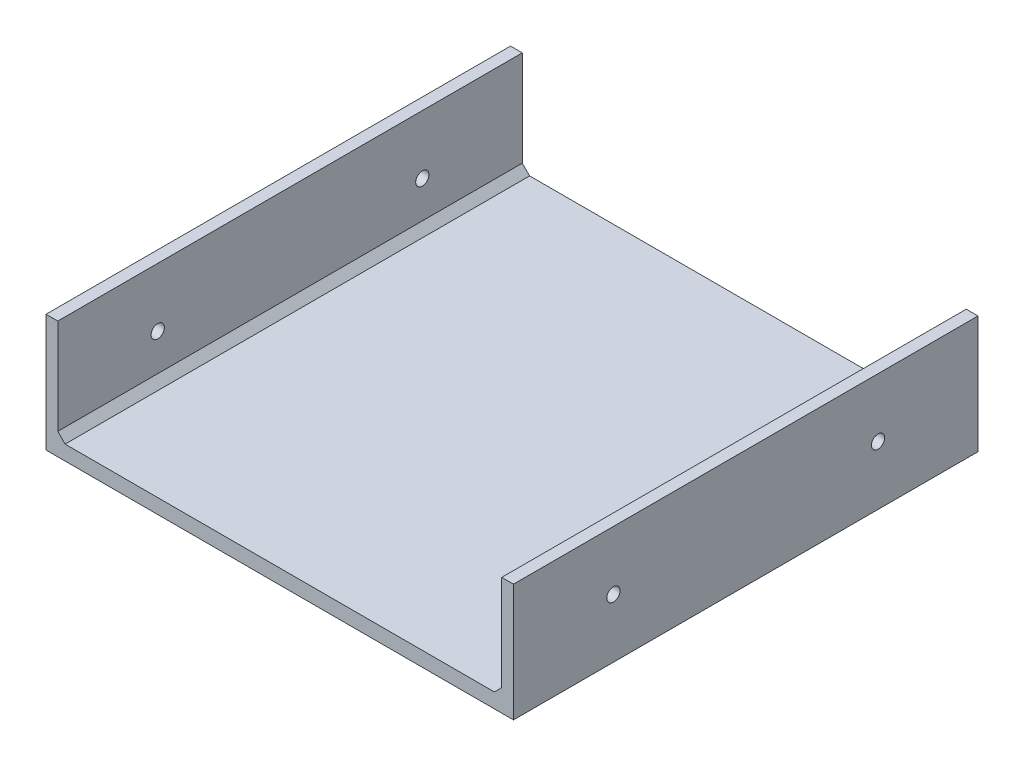
ISO-10303-21;
HEADER;
FILE_DESCRIPTION(('STEP AP214'),'2;1');
FILE_NAME('part.step','',(''),(''),'','','');
FILE_SCHEMA(('AUTOMOTIVE_DESIGN { 1 0 10303 214 1 1 1 1 }'));
ENDSEC;
DATA;
#1=APPLICATION_CONTEXT('core data for automotive mechanical design processes');
#2=APPLICATION_PROTOCOL_DEFINITION('international standard','automotive_design',2000,#1);
#3=PRODUCT_CONTEXT('',#1,'mechanical');
#4=PRODUCT('Part','Part','',(#3));
#5=PRODUCT_RELATED_PRODUCT_CATEGORY('part','',(#4));
#6=PRODUCT_DEFINITION_FORMATION('','',#4);
#7=PRODUCT_DEFINITION_CONTEXT('part definition',#1,'design');
#8=PRODUCT_DEFINITION('design','',#6,#7);
#9=PRODUCT_DEFINITION_SHAPE('','',#8);
#10=(LENGTH_UNIT() NAMED_UNIT(*) SI_UNIT(.MILLI.,.METRE.));
#11=(NAMED_UNIT(*) PLANE_ANGLE_UNIT() SI_UNIT($,.RADIAN.));
#12=(NAMED_UNIT(*) SI_UNIT($,.STERADIAN.) SOLID_ANGLE_UNIT());
#13=UNCERTAINTY_MEASURE_WITH_UNIT(LENGTH_MEASURE(1.E-05),#10,'distance_accuracy_value','');
#14=(GEOMETRIC_REPRESENTATION_CONTEXT(3) GLOBAL_UNCERTAINTY_ASSIGNED_CONTEXT((#13)) GLOBAL_UNIT_ASSIGNED_CONTEXT((#10,
#11,#12)) REPRESENTATION_CONTEXT('',''));
#15=CARTESIAN_POINT('',(0.,0.,0.));
#16=DIRECTION('',(0.,0.,1.));
#17=DIRECTION('',(1.,0.,0.));
#18=AXIS2_PLACEMENT_3D('',#15,#16,#17);
#19=CARTESIAN_POINT('',(-79.5,5.,0.));
#20=DIRECTION('',(1.,0.,0.));
#21=DIRECTION('',(0.,0.,-1.));
#22=AXIS2_PLACEMENT_3D('',#19,#20,#21);
#23=PLANE('',#22);
#24=CARTESIAN_POINT('',(-79.5,20.,34.));
#25=DIRECTION('',(1.,0.,0.));
#26=DIRECTION('',(0.,0.,-1.));
#27=AXIS2_PLACEMENT_3D('',#24,#25,#26);
#28=CIRCLE('',#27,2.25);
#29=CARTESIAN_POINT('',(-79.5,20.,31.75));
#30=VERTEX_POINT('',#29);
#31=EDGE_CURVE('E319',#30,#30,#28,.T.);
#32=ORIENTED_EDGE('',*,*,#31,.T.);
#33=EDGE_LOOP('',(#32));
#34=FACE_BOUND('',#33,.T.);
#35=CARTESIAN_POINT('',(-79.5,20.,124.));
#36=DIRECTION('',(1.,0.,0.));
#37=DIRECTION('',(0.,0.,-1.));
#38=AXIS2_PLACEMENT_3D('',#35,#36,#37);
#39=CIRCLE('',#38,2.25);
#40=CARTESIAN_POINT('',(-79.5,20.,121.75));
#41=VERTEX_POINT('',#40);
#42=EDGE_CURVE('E149',#41,#41,#39,.T.);
#43=ORIENTED_EDGE('',*,*,#42,.T.);
#44=EDGE_LOOP('',(#43));
#45=FACE_BOUND('',#44,.T.);
#46=DIRECTION('',(0.,0.,1.));
#47=VECTOR('',#46,1.);
#48=CARTESIAN_POINT('',(-79.5,0.,0.));
#49=LINE('',#48,#47);
#50=CARTESIAN_POINT('',(-79.5,0.,0.));
#51=VERTEX_POINT('',#50);
#52=CARTESIAN_POINT('',(-79.5,0.,158.));
#53=VERTEX_POINT('',#52);
#54=EDGE_CURVE('E133',#51,#53,#49,.T.);
#55=ORIENTED_EDGE('',*,*,#54,.T.);
#56=DIRECTION('',(0.,-1.,0.));
#57=VECTOR('',#56,1.);
#58=CARTESIAN_POINT('',(-79.5,5.,158.));
#59=LINE('',#58,#57);
#60=CARTESIAN_POINT('',(-79.5,40.,158.));
#61=VERTEX_POINT('',#60);
#62=EDGE_CURVE('E127',#61,#53,#59,.T.);
#63=ORIENTED_EDGE('',*,*,#62,.F.);
#64=DIRECTION('',(0.,0.,-1.));
#65=VECTOR('',#64,1.);
#66=CARTESIAN_POINT('',(-79.5,40.,158.));
#67=LINE('',#66,#65);
#68=CARTESIAN_POINT('',(-79.5,40.,0.));
#69=VERTEX_POINT('',#68);
#70=EDGE_CURVE('E130',#61,#69,#67,.T.);
#71=ORIENTED_EDGE('',*,*,#70,.T.);
#72=DIRECTION('',(0.,-1.,0.));
#73=VECTOR('',#72,1.);
#74=CARTESIAN_POINT('',(-79.5,5.,0.));
#75=LINE('',#74,#73);
#76=EDGE_CURVE('E216',#69,#51,#75,.T.);
#77=ORIENTED_EDGE('',*,*,#76,.T.);
#78=EDGE_LOOP('',(#55,#63,#71,#77));
#79=FACE_BOUND('',#78,.T.);
#80=ADVANCED_FACE('F47',(#34,#45,#79),#23,.F.);
#81=CARTESIAN_POINT('',(-79.5,5.,158.));
#82=DIRECTION('',(0.,0.,-1.));
#83=DIRECTION('',(-1.,0.,0.));
#84=AXIS2_PLACEMENT_3D('',#81,#82,#83);
#85=PLANE('',#84);
#86=DIRECTION('',(1.,0.,0.));
#87=VECTOR('',#86,1.);
#88=CARTESIAN_POINT('',(-79.5,0.,158.));
#89=LINE('',#88,#87);
#90=CARTESIAN_POINT('',(79.5,0.,158.));
#91=VERTEX_POINT('',#90);
#92=EDGE_CURVE('E219',#53,#91,#89,.T.);
#93=ORIENTED_EDGE('',*,*,#92,.T.);
#94=DIRECTION('',(0.,-1.,0.));
#95=VECTOR('',#94,1.);
#96=CARTESIAN_POINT('',(79.5,5.,158.));
#97=LINE('',#96,#95);
#98=CARTESIAN_POINT('',(79.5,40.,158.));
#99=VERTEX_POINT('',#98);
#100=EDGE_CURVE('E138',#99,#91,#97,.T.);
#101=ORIENTED_EDGE('',*,*,#100,.F.);
#102=DIRECTION('',(1.,0.,0.));
#103=VECTOR('',#102,1.);
#104=CARTESIAN_POINT('',(79.5,40.,158.));
#105=LINE('',#104,#103);
#106=CARTESIAN_POINT('',(75.5,40.,158.));
#107=VERTEX_POINT('',#106);
#108=EDGE_CURVE('E197',#107,#99,#105,.T.);
#109=ORIENTED_EDGE('',*,*,#108,.F.);
#110=DIRECTION('',(0.,-1.,0.));
#111=VECTOR('',#110,1.);
#112=CARTESIAN_POINT('',(75.5,40.,158.));
#113=LINE('',#112,#111);
#114=CARTESIAN_POINT('',(75.5,7.50000000000003,158.));
#115=VERTEX_POINT('',#114);
#116=EDGE_CURVE('E201',#107,#115,#113,.T.);
#117=ORIENTED_EDGE('',*,*,#116,.T.);
#118=DIRECTION('',(-0.707106781186544,-0.707106781186551,0.));
#119=VECTOR('',#118,1.);
#120=CARTESIAN_POINT('',(-3.24999999999921,-71.25,158.));
#121=LINE('',#120,#119);
#122=CARTESIAN_POINT('',(73.,5.,158.));
#123=VERTEX_POINT('',#122);
#124=EDGE_CURVE('E57',#115,#123,#121,.T.);
#125=ORIENTED_EDGE('',*,*,#124,.T.);
#126=DIRECTION('',(1.,0.,0.));
#127=VECTOR('',#126,1.);
#128=CARTESIAN_POINT('',(-79.5,5.,158.));
#129=LINE('',#128,#127);
#130=CARTESIAN_POINT('',(-72.9999999999999,5.,158.));
#131=VERTEX_POINT('',#130);
#132=EDGE_CURVE('E207',#131,#123,#129,.T.);
#133=ORIENTED_EDGE('',*,*,#132,.F.);
#134=DIRECTION('',(0.707106781186552,-0.707106781186543,0.));
#135=VECTOR('',#134,1.);
#136=CARTESIAN_POINT('',(-76.25,8.25000000000002,158.));
#137=LINE('',#136,#135);
#138=CARTESIAN_POINT('',(-75.5,7.5,158.));
#139=VERTEX_POINT('',#138);
#140=EDGE_CURVE('E248',#131,#139,#137,.F.);
#141=ORIENTED_EDGE('',*,*,#140,.T.);
#142=DIRECTION('',(0.,-1.,0.));
#143=VECTOR('',#142,1.);
#144=CARTESIAN_POINT('',(-75.5,40.,158.));
#145=LINE('',#144,#143);
#146=CARTESIAN_POINT('',(-75.5,40.,158.));
#147=VERTEX_POINT('',#146);
#148=EDGE_CURVE('E153',#147,#139,#145,.T.);
#149=ORIENTED_EDGE('',*,*,#148,.F.);
#150=DIRECTION('',(-1.,0.,0.));
#151=VECTOR('',#150,1.);
#152=CARTESIAN_POINT('',(-79.5,40.,158.));
#153=LINE('',#152,#151);
#154=EDGE_CURVE('E144',#147,#61,#153,.T.);
#155=ORIENTED_EDGE('',*,*,#154,.T.);
#156=ORIENTED_EDGE('',*,*,#62,.T.);
#157=EDGE_LOOP('',(#93,#101,#109,#117,#125,#133,#141,#149,#155,#156));
#158=FACE_BOUND('',#157,.T.);
#159=ADVANCED_FACE('F151',(#158),#85,.F.);
#160=CARTESIAN_POINT('',(79.5,5.,0.));
#161=DIRECTION('',(-1.,0.,0.));
#162=DIRECTION('',(0.,0.,1.));
#163=AXIS2_PLACEMENT_3D('',#160,#161,#162);
#164=PLANE('',#163);
#165=CARTESIAN_POINT('',(79.5,20.,34.));
#166=DIRECTION('',(-1.,0.,0.));
#167=DIRECTION('',(0.,0.,1.));
#168=AXIS2_PLACEMENT_3D('',#165,#166,#167);
#169=CIRCLE('',#168,2.25);
#170=CARTESIAN_POINT('',(79.5,20.,36.25));
#171=VERTEX_POINT('',#170);
#172=EDGE_CURVE('E175',#171,#171,#169,.T.);
#173=ORIENTED_EDGE('',*,*,#172,.T.);
#174=EDGE_LOOP('',(#173));
#175=FACE_BOUND('',#174,.T.);
#176=CARTESIAN_POINT('',(79.5,20.,124.));
#177=DIRECTION('',(-1.,0.,0.));
#178=DIRECTION('',(0.,0.,1.));
#179=AXIS2_PLACEMENT_3D('',#176,#177,#178);
#180=CIRCLE('',#179,2.25);
#181=CARTESIAN_POINT('',(79.5,20.,126.25));
#182=VERTEX_POINT('',#181);
#183=EDGE_CURVE('E183',#182,#182,#180,.T.);
#184=ORIENTED_EDGE('',*,*,#183,.T.);
#185=EDGE_LOOP('',(#184));
#186=FACE_BOUND('',#185,.T.);
#187=DIRECTION('',(0.,0.,-1.));
#188=VECTOR('',#187,1.);
#189=CARTESIAN_POINT('',(79.5,0.,0.));
#190=LINE('',#189,#188);
#191=CARTESIAN_POINT('',(79.5,0.,0.));
#192=VERTEX_POINT('',#191);
#193=EDGE_CURVE('E222',#91,#192,#190,.T.);
#194=ORIENTED_EDGE('',*,*,#193,.T.);
#195=DIRECTION('',(0.,-1.,0.));
#196=VECTOR('',#195,1.);
#197=CARTESIAN_POINT('',(79.5,5.,0.));
#198=LINE('',#197,#196);
#199=CARTESIAN_POINT('',(79.5,40.,0.));
#200=VERTEX_POINT('',#199);
#201=EDGE_CURVE('E229',#200,#192,#198,.T.);
#202=ORIENTED_EDGE('',*,*,#201,.F.);
#203=DIRECTION('',(0.,0.,-1.));
#204=VECTOR('',#203,1.);
#205=CARTESIAN_POINT('',(79.5,40.,158.));
#206=LINE('',#205,#204);
#207=EDGE_CURVE('E187',#99,#200,#206,.T.);
#208=ORIENTED_EDGE('',*,*,#207,.F.);
#209=ORIENTED_EDGE('',*,*,#100,.T.);
#210=EDGE_LOOP('',(#194,#202,#208,#209));
#211=FACE_BOUND('',#210,.T.);
#212=ADVANCED_FACE('F270',(#175,#186,#211),#164,.F.);
#213=CARTESIAN_POINT('',(-79.5,5.,0.));
#214=DIRECTION('',(0.,0.,1.));
#215=DIRECTION('',(1.,0.,0.));
#216=AXIS2_PLACEMENT_3D('',#213,#214,#215);
#217=PLANE('',#216);
#218=DIRECTION('',(-1.,0.,0.));
#219=VECTOR('',#218,1.);
#220=CARTESIAN_POINT('',(-79.5,0.,0.));
#221=LINE('',#220,#219);
#222=EDGE_CURVE('E212',#192,#51,#221,.T.);
#223=ORIENTED_EDGE('',*,*,#222,.T.);
#224=ORIENTED_EDGE('',*,*,#76,.F.);
#225=DIRECTION('',(1.,0.,0.));
#226=VECTOR('',#225,1.);
#227=CARTESIAN_POINT('',(-79.5,40.,0.));
#228=LINE('',#227,#226);
#229=CARTESIAN_POINT('',(-75.5,40.,0.));
#230=VERTEX_POINT('',#229);
#231=EDGE_CURVE('E147',#69,#230,#228,.T.);
#232=ORIENTED_EDGE('',*,*,#231,.T.);
#233=DIRECTION('',(0.,-1.,0.));
#234=VECTOR('',#233,1.);
#235=CARTESIAN_POINT('',(-75.5,40.,0.));
#236=LINE('',#235,#234);
#237=CARTESIAN_POINT('',(-75.5,7.5,0.));
#238=VERTEX_POINT('',#237);
#239=EDGE_CURVE('E165',#230,#238,#236,.T.);
#240=ORIENTED_EDGE('',*,*,#239,.T.);
#241=DIRECTION('',(-0.707106781186552,0.707106781186543,0.));
#242=VECTOR('',#241,1.);
#243=CARTESIAN_POINT('',(-76.25,8.25000000000001,0.));
#244=LINE('',#243,#242);
#245=CARTESIAN_POINT('',(-73.,5.,0.));
#246=VERTEX_POINT('',#245);
#247=EDGE_CURVE('E251',#238,#246,#244,.F.);
#248=ORIENTED_EDGE('',*,*,#247,.T.);
#249=DIRECTION('',(-1.,0.,0.));
#250=VECTOR('',#249,1.);
#251=CARTESIAN_POINT('',(-79.5,5.,0.));
#252=LINE('',#251,#250);
#253=CARTESIAN_POINT('',(73.,5.,0.));
#254=VERTEX_POINT('',#253);
#255=EDGE_CURVE('E211',#254,#246,#252,.T.);
#256=ORIENTED_EDGE('',*,*,#255,.F.);
#257=DIRECTION('',(0.707106781186544,0.707106781186551,0.));
#258=VECTOR('',#257,1.);
#259=CARTESIAN_POINT('',(-3.24999999999923,-71.25,0.));
#260=LINE('',#259,#258);
#261=CARTESIAN_POINT('',(75.5,7.50000000000003,0.));
#262=VERTEX_POINT('',#261);
#263=EDGE_CURVE('E11',#254,#262,#260,.T.);
#264=ORIENTED_EDGE('',*,*,#263,.T.);
#265=DIRECTION('',(0.,-1.,0.));
#266=VECTOR('',#265,1.);
#267=CARTESIAN_POINT('',(75.5,40.,0.));
#268=LINE('',#267,#266);
#269=CARTESIAN_POINT('',(75.5,40.,0.));
#270=VERTEX_POINT('',#269);
#271=EDGE_CURVE('E204',#270,#262,#268,.T.);
#272=ORIENTED_EDGE('',*,*,#271,.F.);
#273=DIRECTION('',(-1.,0.,0.));
#274=VECTOR('',#273,1.);
#275=CARTESIAN_POINT('',(79.5,40.,0.));
#276=LINE('',#275,#274);
#277=EDGE_CURVE('E191',#200,#270,#276,.T.);
#278=ORIENTED_EDGE('',*,*,#277,.F.);
#279=ORIENTED_EDGE('',*,*,#201,.T.);
#280=EDGE_LOOP('',(#223,#224,#232,#240,#248,#256,#264,#272,#278,#279));
#281=FACE_BOUND('',#280,.T.);
#282=ADVANCED_FACE('F264',(#281),#217,.F.);
#283=CARTESIAN_POINT('',(0.,5.,0.));
#284=DIRECTION('',(0.,1.,0.));
#285=DIRECTION('',(0.,0.,1.));
#286=AXIS2_PLACEMENT_3D('',#283,#284,#285);
#287=PLANE('',#286);
#288=ORIENTED_EDGE('',*,*,#255,.T.);
#289=DIRECTION('',(0.,0.,1.));
#290=VECTOR('',#289,1.);
#291=CARTESIAN_POINT('',(-72.9999999999999,5.,158.));
#292=LINE('',#291,#290);
#293=EDGE_CURVE('E238',#246,#131,#292,.T.);
#294=ORIENTED_EDGE('',*,*,#293,.T.);
#295=ORIENTED_EDGE('',*,*,#132,.T.);
#296=DIRECTION('',(0.,0.,-1.));
#297=VECTOR('',#296,1.);
#298=CARTESIAN_POINT('',(73.,5.,0.));
#299=LINE('',#298,#297);
#300=EDGE_CURVE('E137',#123,#254,#299,.T.);
#301=ORIENTED_EDGE('',*,*,#300,.T.);
#302=EDGE_LOOP('',(#288,#294,#295,#301));
#303=FACE_BOUND('',#302,.T.);
#304=ADVANCED_FACE('F258',(#303),#287,.T.);
#305=CARTESIAN_POINT('',(0.,0.,0.));
#306=DIRECTION('',(0.,1.,0.));
#307=DIRECTION('',(0.,0.,1.));
#308=AXIS2_PLACEMENT_3D('',#305,#306,#307);
#309=PLANE('',#308);
#310=ORIENTED_EDGE('',*,*,#54,.F.);
#311=ORIENTED_EDGE('',*,*,#222,.F.);
#312=ORIENTED_EDGE('',*,*,#193,.F.);
#313=ORIENTED_EDGE('',*,*,#92,.F.);
#314=EDGE_LOOP('',(#310,#311,#312,#313));
#315=FACE_BOUND('',#314,.T.);
#316=ADVANCED_FACE('F273',(#315),#309,.F.);
#317=CARTESIAN_POINT('',(75.5,40.,158.));
#318=DIRECTION('',(1.,0.,0.));
#319=DIRECTION('',(0.,0.,-1.));
#320=AXIS2_PLACEMENT_3D('',#317,#318,#319);
#321=PLANE('',#320);
#322=CARTESIAN_POINT('',(75.5,20.,34.));
#323=DIRECTION('',(-1.,0.,0.));
#324=DIRECTION('',(0.,0.,1.));
#325=AXIS2_PLACEMENT_3D('',#322,#323,#324);
#326=CIRCLE('',#325,2.25);
#327=CARTESIAN_POINT('',(75.5,20.,36.25));
#328=VERTEX_POINT('',#327);
#329=EDGE_CURVE('E171',#328,#328,#326,.T.);
#330=ORIENTED_EDGE('',*,*,#329,.F.);
#331=EDGE_LOOP('',(#330));
#332=FACE_BOUND('',#331,.T.);
#333=CARTESIAN_POINT('',(75.5,20.,124.));
#334=DIRECTION('',(-1.,0.,0.));
#335=DIRECTION('',(0.,0.,1.));
#336=AXIS2_PLACEMENT_3D('',#333,#334,#335);
#337=CIRCLE('',#336,2.25);
#338=CARTESIAN_POINT('',(75.5,20.,126.25));
#339=VERTEX_POINT('',#338);
#340=EDGE_CURVE('E179',#339,#339,#337,.T.);
#341=ORIENTED_EDGE('',*,*,#340,.F.);
#342=EDGE_LOOP('',(#341));
#343=FACE_BOUND('',#342,.T.);
#344=ORIENTED_EDGE('',*,*,#271,.T.);
#345=DIRECTION('',(0.,0.,1.));
#346=VECTOR('',#345,1.);
#347=CARTESIAN_POINT('',(75.5,7.50000000000003,158.));
#348=LINE('',#347,#346);
#349=EDGE_CURVE('E245',#262,#115,#348,.T.);
#350=ORIENTED_EDGE('',*,*,#349,.T.);
#351=ORIENTED_EDGE('',*,*,#116,.F.);
#352=DIRECTION('',(0.,0.,1.));
#353=VECTOR('',#352,1.);
#354=CARTESIAN_POINT('',(75.5,40.,158.));
#355=LINE('',#354,#353);
#356=EDGE_CURVE('E194',#270,#107,#355,.T.);
#357=ORIENTED_EDGE('',*,*,#356,.F.);
#358=EDGE_LOOP('',(#344,#350,#351,#357));
#359=FACE_BOUND('',#358,.T.);
#360=ADVANCED_FACE('F261',(#332,#343,#359),#321,.F.);
#361=CARTESIAN_POINT('',(0.,40.,0.));
#362=DIRECTION('',(0.,1.,0.));
#363=DIRECTION('',(0.,0.,1.));
#364=AXIS2_PLACEMENT_3D('',#361,#362,#363);
#365=PLANE('',#364);
#366=ORIENTED_EDGE('',*,*,#207,.T.);
#367=ORIENTED_EDGE('',*,*,#277,.T.);
#368=ORIENTED_EDGE('',*,*,#356,.T.);
#369=ORIENTED_EDGE('',*,*,#108,.T.);
#370=EDGE_LOOP('',(#366,#367,#368,#369));
#371=FACE_BOUND('',#370,.T.);
#372=ADVANCED_FACE('F268',(#371),#365,.T.);
#373=CARTESIAN_POINT('',(75.5,20.,124.));
#374=DIRECTION('',(-1.,0.,0.));
#375=DIRECTION('',(0.,0.,1.));
#376=AXIS2_PLACEMENT_3D('',#373,#374,#375);
#377=CYLINDRICAL_SURFACE('',#376,2.25);
#378=ORIENTED_EDGE('',*,*,#183,.F.);
#379=EDGE_LOOP('',(#378));
#380=FACE_BOUND('',#379,.T.);
#381=ORIENTED_EDGE('',*,*,#340,.T.);
#382=EDGE_LOOP('',(#381));
#383=FACE_BOUND('',#382,.T.);
#384=ADVANCED_FACE('F289',(#380,#383),#377,.F.);
#385=CARTESIAN_POINT('',(75.5,20.,34.));
#386=DIRECTION('',(-1.,0.,0.));
#387=DIRECTION('',(0.,0.,1.));
#388=AXIS2_PLACEMENT_3D('',#385,#386,#387);
#389=CYLINDRICAL_SURFACE('',#388,2.25);
#390=ORIENTED_EDGE('',*,*,#172,.F.);
#391=EDGE_LOOP('',(#390));
#392=FACE_BOUND('',#391,.T.);
#393=ORIENTED_EDGE('',*,*,#329,.T.);
#394=EDGE_LOOP('',(#393));
#395=FACE_BOUND('',#394,.T.);
#396=ADVANCED_FACE('F281',(#392,#395),#389,.F.);
#397=CARTESIAN_POINT('',(-75.5,40.,158.));
#398=DIRECTION('',(1.,0.,0.));
#399=DIRECTION('',(0.,0.,-1.));
#400=AXIS2_PLACEMENT_3D('',#397,#398,#399);
#401=PLANE('',#400);
#402=CARTESIAN_POINT('',(-75.5,20.,34.));
#403=DIRECTION('',(1.,0.,0.));
#404=DIRECTION('',(0.,0.,-1.));
#405=AXIS2_PLACEMENT_3D('',#402,#403,#404);
#406=CIRCLE('',#405,2.25);
#407=CARTESIAN_POINT('',(-75.5,20.,31.75));
#408=VERTEX_POINT('',#407);
#409=EDGE_CURVE('E321',#408,#408,#406,.T.);
#410=ORIENTED_EDGE('',*,*,#409,.F.);
#411=EDGE_LOOP('',(#410));
#412=FACE_BOUND('',#411,.T.);
#413=CARTESIAN_POINT('',(-75.5,20.,124.));
#414=DIRECTION('',(1.,0.,0.));
#415=DIRECTION('',(0.,0.,-1.));
#416=AXIS2_PLACEMENT_3D('',#413,#414,#415);
#417=CIRCLE('',#416,2.25);
#418=CARTESIAN_POINT('',(-75.5,20.,121.75));
#419=VERTEX_POINT('',#418);
#420=EDGE_CURVE('E324',#419,#419,#417,.T.);
#421=ORIENTED_EDGE('',*,*,#420,.F.);
#422=EDGE_LOOP('',(#421));
#423=FACE_BOUND('',#422,.T.);
#424=ORIENTED_EDGE('',*,*,#148,.T.);
#425=DIRECTION('',(0.,0.,-1.));
#426=VECTOR('',#425,1.);
#427=CARTESIAN_POINT('',(-75.5,7.5,0.));
#428=LINE('',#427,#426);
#429=EDGE_CURVE('E242',#139,#238,#428,.T.);
#430=ORIENTED_EDGE('',*,*,#429,.T.);
#431=ORIENTED_EDGE('',*,*,#239,.F.);
#432=DIRECTION('',(0.,0.,1.));
#433=VECTOR('',#432,1.);
#434=CARTESIAN_POINT('',(-75.5,40.,158.));
#435=LINE('',#434,#433);
#436=EDGE_CURVE('E155',#230,#147,#435,.T.);
#437=ORIENTED_EDGE('',*,*,#436,.T.);
#438=EDGE_LOOP('',(#424,#430,#431,#437));
#439=FACE_BOUND('',#438,.T.);
#440=ADVANCED_FACE('F279',(#412,#423,#439),#401,.T.);
#441=CARTESIAN_POINT('',(0.,40.,0.));
#442=DIRECTION('',(0.,1.,0.));
#443=DIRECTION('',(0.,0.,1.));
#444=AXIS2_PLACEMENT_3D('',#441,#442,#443);
#445=PLANE('',#444);
#446=ORIENTED_EDGE('',*,*,#70,.F.);
#447=ORIENTED_EDGE('',*,*,#154,.F.);
#448=ORIENTED_EDGE('',*,*,#436,.F.);
#449=ORIENTED_EDGE('',*,*,#231,.F.);
#450=EDGE_LOOP('',(#446,#447,#448,#449));
#451=FACE_BOUND('',#450,.T.);
#452=ADVANCED_FACE('F142',(#451),#445,.T.);
#453=CARTESIAN_POINT('',(-75.5,20.,124.));
#454=DIRECTION('',(1.,0.,0.));
#455=DIRECTION('',(0.,0.,-1.));
#456=AXIS2_PLACEMENT_3D('',#453,#454,#455);
#457=CYLINDRICAL_SURFACE('',#456,2.25);
#458=ORIENTED_EDGE('',*,*,#42,.F.);
#459=EDGE_LOOP('',(#458));
#460=FACE_BOUND('',#459,.T.);
#461=ORIENTED_EDGE('',*,*,#420,.T.);
#462=EDGE_LOOP('',(#461));
#463=FACE_BOUND('',#462,.T.);
#464=ADVANCED_FACE('F287',(#460,#463),#457,.F.);
#465=CARTESIAN_POINT('',(-75.5,20.,34.));
#466=DIRECTION('',(1.,0.,0.));
#467=DIRECTION('',(0.,0.,-1.));
#468=AXIS2_PLACEMENT_3D('',#465,#466,#467);
#469=CYLINDRICAL_SURFACE('',#468,2.25);
#470=ORIENTED_EDGE('',*,*,#31,.F.);
#471=EDGE_LOOP('',(#470));
#472=FACE_BOUND('',#471,.T.);
#473=ORIENTED_EDGE('',*,*,#409,.T.);
#474=EDGE_LOOP('',(#473));
#475=FACE_BOUND('',#474,.T.);
#476=ADVANCED_FACE('F307',(#472,#475),#469,.F.);
#477=CARTESIAN_POINT('',(-73.,5.,0.));
#478=DIRECTION('',(0.707106781186543,0.707106781186552,0.));
#479=DIRECTION('',(0.,0.,-1.));
#480=AXIS2_PLACEMENT_3D('',#477,#478,#479);
#481=PLANE('',#480);
#482=ORIENTED_EDGE('',*,*,#247,.F.);
#483=ORIENTED_EDGE('',*,*,#429,.F.);
#484=ORIENTED_EDGE('',*,*,#140,.F.);
#485=ORIENTED_EDGE('',*,*,#293,.F.);
#486=EDGE_LOOP('',(#482,#483,#484,#485));
#487=FACE_BOUND('',#486,.T.);
#488=ADVANCED_FACE('F278',(#487),#481,.T.);
#489=CARTESIAN_POINT('',(75.5,7.50000000000003,158.));
#490=DIRECTION('',(0.707106781186551,-0.707106781186544,0.));
#491=DIRECTION('',(0.,0.,1.));
#492=AXIS2_PLACEMENT_3D('',#489,#490,#491);
#493=PLANE('',#492);
#494=ORIENTED_EDGE('',*,*,#263,.F.);
#495=ORIENTED_EDGE('',*,*,#300,.F.);
#496=ORIENTED_EDGE('',*,*,#124,.F.);
#497=ORIENTED_EDGE('',*,*,#349,.F.);
#498=EDGE_LOOP('',(#494,#495,#496,#497));
#499=FACE_BOUND('',#498,.T.);
#500=ADVANCED_FACE('F50',(#499),#493,.F.);
#501=CLOSED_SHELL('',(#80,#159,#212,#282,#304,#316,#360,#372,#384,#396,#440,#452,#464,#476,#488,#500));
#502=MANIFOLD_SOLID_BREP('B2',#501);
#503=ADVANCED_BREP_SHAPE_REPRESENTATION('',(#18,#502),#14);
#504=SHAPE_DEFINITION_REPRESENTATION(#9,#503);
ENDSEC;
END-ISO-10303-21;
